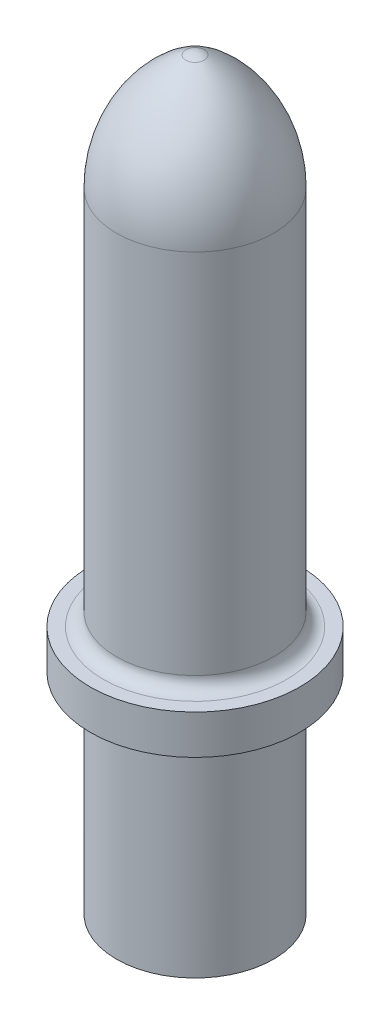
ISO-10303-21;
HEADER;
FILE_DESCRIPTION(('STEP AP214'),'2;1');
FILE_NAME('part.step','',(''),(''),'','','');
FILE_SCHEMA(('AUTOMOTIVE_DESIGN { 1 0 10303 214 1 1 1 1 }'));
ENDSEC;
DATA;
#1=APPLICATION_CONTEXT('core data for automotive mechanical design processes');
#2=APPLICATION_PROTOCOL_DEFINITION('international standard','automotive_design',2000,#1);
#3=PRODUCT_CONTEXT('',#1,'mechanical');
#4=PRODUCT('Part','Part','',(#3));
#5=PRODUCT_RELATED_PRODUCT_CATEGORY('part','',(#4));
#6=PRODUCT_DEFINITION_FORMATION('','',#4);
#7=PRODUCT_DEFINITION_CONTEXT('part definition',#1,'design');
#8=PRODUCT_DEFINITION('design','',#6,#7);
#9=PRODUCT_DEFINITION_SHAPE('','',#8);
#10=(LENGTH_UNIT() NAMED_UNIT(*) SI_UNIT(.MILLI.,.METRE.));
#11=(NAMED_UNIT(*) PLANE_ANGLE_UNIT() SI_UNIT($,.RADIAN.));
#12=(NAMED_UNIT(*) SI_UNIT($,.STERADIAN.) SOLID_ANGLE_UNIT());
#13=UNCERTAINTY_MEASURE_WITH_UNIT(LENGTH_MEASURE(1.E-05),#10,'distance_accuracy_value','');
#14=(GEOMETRIC_REPRESENTATION_CONTEXT(3) GLOBAL_UNCERTAINTY_ASSIGNED_CONTEXT((#13)) GLOBAL_UNIT_ASSIGNED_CONTEXT((#10,
#11,#12)) REPRESENTATION_CONTEXT('',''));
#15=CARTESIAN_POINT('',(0.,0.,0.));
#16=DIRECTION('',(0.,0.,1.));
#17=DIRECTION('',(1.,0.,0.));
#18=AXIS2_PLACEMENT_3D('',#15,#16,#17);
#19=CARTESIAN_POINT('',(0.,-56.941632852948,0.));
#20=DIRECTION('',(0.,-1.,0.));
#21=DIRECTION('',(0.,0.,-1.));
#22=AXIS2_PLACEMENT_3D('',#19,#20,#21);
#23=PLANE('',#22);
#24=CARTESIAN_POINT('',(0.,-56.941632852948,0.));
#25=DIRECTION('',(0.,1.,0.));
#26=DIRECTION('',(0.,0.,1.));
#27=AXIS2_PLACEMENT_3D('',#24,#25,#26);
#28=CIRCLE('',#27,19.05);
#29=CARTESIAN_POINT('',(0.,-56.941632852948,19.05));
#30=VERTEX_POINT('',#29);
#31=EDGE_CURVE('E61',#30,#30,#28,.T.);
#32=ORIENTED_EDGE('',*,*,#31,.F.);
#33=EDGE_LOOP('',(#32));
#34=FACE_BOUND('',#33,.T.);
#35=ADVANCED_FACE('F37',(#34),#23,.T.);
#36=CARTESIAN_POINT('',(0.,95.458367147052,0.));
#37=DIRECTION('',(0.,1.,0.));
#38=DIRECTION('',(0.,0.,1.));
#39=AXIS2_PLACEMENT_3D('',#36,#37,#38);
#40=CYLINDRICAL_SURFACE('',#39,19.05);
#41=CARTESIAN_POINT('',(0.,-9.31663285294797,0.));
#42=DIRECTION('',(0.,-1.,0.));
#43=DIRECTION('',(0.,0.,-1.));
#44=AXIS2_PLACEMENT_3D('',#41,#42,#43);
#45=CIRCLE('',#44,19.05);
#46=CARTESIAN_POINT('',(0.,-9.31663285294797,-19.05));
#47=VERTEX_POINT('',#46);
#48=EDGE_CURVE('E50',#47,#47,#45,.T.);
#49=ORIENTED_EDGE('',*,*,#48,.T.);
#50=EDGE_LOOP('',(#49));
#51=FACE_BOUND('',#50,.T.);
#52=ORIENTED_EDGE('',*,*,#31,.T.);
#53=EDGE_LOOP('',(#52));
#54=FACE_BOUND('',#53,.T.);
#55=ADVANCED_FACE('F98',(#51,#54),#40,.T.);
#56=CARTESIAN_POINT('',(-25.4,-6.14163285294797,0.));
#57=DIRECTION('',(0.,-1.,0.));
#58=DIRECTION('',(0.,0.,-1.));
#59=AXIS2_PLACEMENT_3D('',#56,#57,#58);
#60=PLANE('',#59);
#61=CARTESIAN_POINT('',(0.,-6.14163285294797,0.));
#62=DIRECTION('',(0.,-1.,0.));
#63=DIRECTION('',(0.,0.,-1.));
#64=AXIS2_PLACEMENT_3D('',#61,#62,#63);
#65=CIRCLE('',#64,22.225);
#66=CARTESIAN_POINT('',(0.,-6.14163285294797,-22.225));
#67=VERTEX_POINT('',#66);
#68=EDGE_CURVE('E55',#67,#67,#65,.F.);
#69=ORIENTED_EDGE('',*,*,#68,.T.);
#70=EDGE_LOOP('',(#69));
#71=FACE_BOUND('',#70,.T.);
#72=CARTESIAN_POINT('',(0.,-6.14163285294797,0.));
#73=DIRECTION('',(0.,1.,0.));
#74=DIRECTION('',(0.,0.,1.));
#75=AXIS2_PLACEMENT_3D('',#72,#73,#74);
#76=CIRCLE('',#75,25.4);
#77=CARTESIAN_POINT('',(0.,-6.14163285294797,25.4));
#78=VERTEX_POINT('',#77);
#79=EDGE_CURVE('E65',#78,#78,#76,.T.);
#80=ORIENTED_EDGE('',*,*,#79,.F.);
#81=EDGE_LOOP('',(#80));
#82=FACE_BOUND('',#81,.T.);
#83=ADVANCED_FACE('F104',(#71,#82),#60,.T.);
#84=CARTESIAN_POINT('',(0.,95.458367147052,0.));
#85=DIRECTION('',(0.,1.,0.));
#86=DIRECTION('',(0.,0.,1.));
#87=AXIS2_PLACEMENT_3D('',#84,#85,#86);
#88=CYLINDRICAL_SURFACE('',#87,25.4);
#89=ORIENTED_EDGE('',*,*,#79,.T.);
#90=EDGE_LOOP('',(#89));
#91=FACE_BOUND('',#90,.T.);
#92=CARTESIAN_POINT('',(0.,3.38336714705204,0.));
#93=DIRECTION('',(0.,1.,0.));
#94=DIRECTION('',(0.,0.,1.));
#95=AXIS2_PLACEMENT_3D('',#92,#93,#94);
#96=CIRCLE('',#95,25.4);
#97=CARTESIAN_POINT('',(0.,3.38336714705204,25.4));
#98=VERTEX_POINT('',#97);
#99=EDGE_CURVE('E69',#98,#98,#96,.T.);
#100=ORIENTED_EDGE('',*,*,#99,.F.);
#101=EDGE_LOOP('',(#100));
#102=FACE_BOUND('',#101,.T.);
#103=ADVANCED_FACE('F121',(#91,#102),#88,.T.);
#104=CARTESIAN_POINT('',(-25.4,3.38336714705204,0.));
#105=DIRECTION('',(0.,1.,0.));
#106=DIRECTION('',(0.,0.,1.));
#107=AXIS2_PLACEMENT_3D('',#104,#105,#106);
#108=PLANE('',#107);
#109=CARTESIAN_POINT('',(0.,3.38336714705204,0.));
#110=DIRECTION('',(0.,1.,0.));
#111=DIRECTION('',(0.,0.,1.));
#112=AXIS2_PLACEMENT_3D('',#109,#110,#111);
#113=CIRCLE('',#112,22.225);
#114=CARTESIAN_POINT('',(0.,3.38336714705204,22.225));
#115=VERTEX_POINT('',#114);
#116=EDGE_CURVE('E10',#115,#115,#113,.F.);
#117=ORIENTED_EDGE('',*,*,#116,.T.);
#118=EDGE_LOOP('',(#117));
#119=FACE_BOUND('',#118,.T.);
#120=ORIENTED_EDGE('',*,*,#99,.T.);
#121=EDGE_LOOP('',(#120));
#122=FACE_BOUND('',#121,.T.);
#123=ADVANCED_FACE('F95',(#119,#122),#108,.T.);
#124=CARTESIAN_POINT('',(0.,95.458367147052,0.));
#125=DIRECTION('',(0.,1.,0.));
#126=DIRECTION('',(0.,0.,1.));
#127=AXIS2_PLACEMENT_3D('',#124,#125,#126);
#128=CYLINDRICAL_SURFACE('',#127,19.05);
#129=CARTESIAN_POINT('',(0.,6.55836714705203,0.));
#130=DIRECTION('',(0.,1.,0.));
#131=DIRECTION('',(0.,0.,1.));
#132=AXIS2_PLACEMENT_3D('',#129,#130,#131);
#133=CIRCLE('',#132,19.05);
#134=CARTESIAN_POINT('',(0.,6.55836714705203,19.05));
#135=VERTEX_POINT('',#134);
#136=EDGE_CURVE('E45',#135,#135,#133,.T.);
#137=ORIENTED_EDGE('',*,*,#136,.T.);
#138=EDGE_LOOP('',(#137));
#139=FACE_BOUND('',#138,.T.);
#140=CARTESIAN_POINT('',(0.,95.458367147052,0.));
#141=DIRECTION('',(0.,1.,0.));
#142=DIRECTION('',(0.,0.,1.));
#143=AXIS2_PLACEMENT_3D('',#140,#141,#142);
#144=CIRCLE('',#143,19.05);
#145=CARTESIAN_POINT('',(0.,95.458367147052,19.05));
#146=VERTEX_POINT('',#145);
#147=EDGE_CURVE('E73',#146,#146,#144,.T.);
#148=ORIENTED_EDGE('',*,*,#147,.F.);
#149=EDGE_LOOP('',(#148));
#150=FACE_BOUND('',#149,.T.);
#151=ADVANCED_FACE('F86',(#139,#150),#128,.T.);
#152=CARTESIAN_POINT('',(0.,95.458367147052,0.));
#153=DIRECTION('',(0.,1.,0.));
#154=DIRECTION('',(0.,0.,1.));
#155=AXIS2_PLACEMENT_3D('',#152,#153,#154);
#156=DEGENERATE_TOROIDAL_SURFACE('',#155,12.5115108257695,31.5615108257695,.F.);
#157=ORIENTED_EDGE('',*,*,#147,.T.);
#158=EDGE_LOOP('',(#157));
#159=FACE_BOUND('',#158,.T.);
#160=CARTESIAN_POINT('',(0.,123.369119633297,0.));
#161=DIRECTION('',(0.,1.,0.));
#162=DIRECTION('',(0.,0.,1.));
#163=AXIS2_PLACEMENT_3D('',#160,#161,#162);
#164=CIRCLE('',#163,2.22344289851289);
#165=CARTESIAN_POINT('',(0.,123.369119633297,2.22344289851289));
#166=VERTEX_POINT('',#165);
#167=EDGE_CURVE('E77',#166,#166,#164,.T.);
#168=ORIENTED_EDGE('',*,*,#167,.F.);
#169=EDGE_LOOP('',(#168));
#170=FACE_BOUND('',#169,.T.);
#171=ADVANCED_FACE('F84',(#159,#170),#156,.F.);
#172=CARTESIAN_POINT('',(0.,119.157503800027,0.));
#173=DIRECTION('',(0.,1.,0.));
#174=DIRECTION('',(1.,0.,0.));
#175=AXIS2_PLACEMENT_3D('',#172,#173,#174);
#176=SPHERICAL_SURFACE('',#175,4.7625);
#177=ORIENTED_EDGE('',*,*,#167,.T.);
#178=EDGE_LOOP('',(#177));
#179=FACE_BOUND('',#178,.T.);
#180=ADVANCED_FACE('F82',(#179),#176,.T.);
#181=CARTESIAN_POINT('',(0.,-9.31663285294797,0.));
#182=DIRECTION('',(0.,-1.,0.));
#183=DIRECTION('',(0.,0.,-1.));
#184=AXIS2_PLACEMENT_3D('',#181,#182,#183);
#185=TOROIDAL_SURFACE('',#184,22.225,3.175);
#186=ORIENTED_EDGE('',*,*,#48,.F.);
#187=EDGE_LOOP('',(#186));
#188=FACE_BOUND('',#187,.T.);
#189=ORIENTED_EDGE('',*,*,#68,.F.);
#190=EDGE_LOOP('',(#189));
#191=FACE_BOUND('',#190,.T.);
#192=ADVANCED_FACE('F93',(#188,#191),#185,.F.);
#193=CARTESIAN_POINT('',(0.,6.55836714705203,0.));
#194=DIRECTION('',(0.,1.,0.));
#195=DIRECTION('',(0.,0.,1.));
#196=AXIS2_PLACEMENT_3D('',#193,#194,#195);
#197=TOROIDAL_SURFACE('',#196,22.225,3.175);
#198=ORIENTED_EDGE('',*,*,#116,.F.);
#199=EDGE_LOOP('',(#198));
#200=FACE_BOUND('',#199,.T.);
#201=ORIENTED_EDGE('',*,*,#136,.F.);
#202=EDGE_LOOP('',(#201));
#203=FACE_BOUND('',#202,.T.);
#204=ADVANCED_FACE('F39',(#200,#203),#197,.F.);
#205=CLOSED_SHELL('',(#35,#55,#83,#103,#123,#151,#171,#180,#192,#204));
#206=MANIFOLD_SOLID_BREP('B2',#205);
#207=ADVANCED_BREP_SHAPE_REPRESENTATION('',(#18,#206),#14);
#208=SHAPE_DEFINITION_REPRESENTATION(#9,#207);
ENDSEC;
END-ISO-10303-21;
